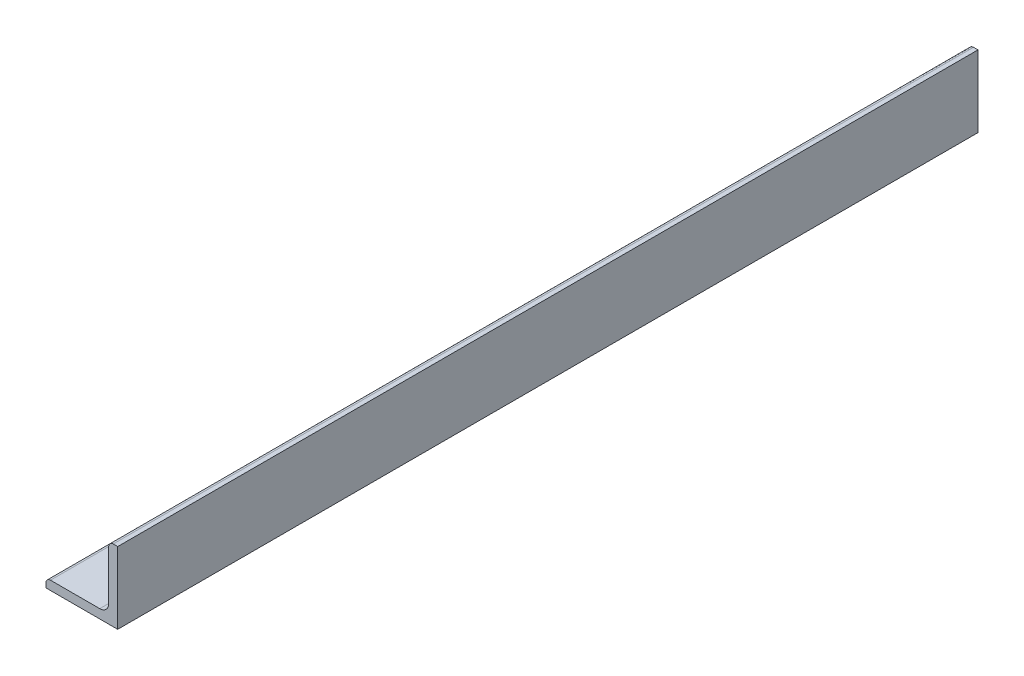
ISO-10303-21;
HEADER;
FILE_DESCRIPTION(('STEP AP214'),'2;1');
FILE_NAME('part.step','',(''),(''),'','','');
FILE_SCHEMA(('AUTOMOTIVE_DESIGN { 1 0 10303 214 1 1 1 1 }'));
ENDSEC;
DATA;
#1=APPLICATION_CONTEXT('core data for automotive mechanical design processes');
#2=APPLICATION_PROTOCOL_DEFINITION('international standard','automotive_design',2000,#1);
#3=PRODUCT_CONTEXT('',#1,'mechanical');
#4=PRODUCT('Part','Part','',(#3));
#5=PRODUCT_RELATED_PRODUCT_CATEGORY('part','',(#4));
#6=PRODUCT_DEFINITION_FORMATION('','',#4);
#7=PRODUCT_DEFINITION_CONTEXT('part definition',#1,'design');
#8=PRODUCT_DEFINITION('design','',#6,#7);
#9=PRODUCT_DEFINITION_SHAPE('','',#8);
#10=(LENGTH_UNIT() NAMED_UNIT(*) SI_UNIT(.MILLI.,.METRE.));
#11=(NAMED_UNIT(*) PLANE_ANGLE_UNIT() SI_UNIT($,.RADIAN.));
#12=(NAMED_UNIT(*) SI_UNIT($,.STERADIAN.) SOLID_ANGLE_UNIT());
#13=UNCERTAINTY_MEASURE_WITH_UNIT(LENGTH_MEASURE(1.E-05),#10,'distance_accuracy_value','');
#14=(GEOMETRIC_REPRESENTATION_CONTEXT(3) GLOBAL_UNCERTAINTY_ASSIGNED_CONTEXT((#13)) GLOBAL_UNIT_ASSIGNED_CONTEXT((#10,
#11,#12)) REPRESENTATION_CONTEXT('',''));
#15=CARTESIAN_POINT('',(0.,0.,0.));
#16=DIRECTION('',(0.,0.,1.));
#17=DIRECTION('',(1.,0.,0.));
#18=AXIS2_PLACEMENT_3D('',#15,#16,#17);
#19=CARTESIAN_POINT('',(-12.7,-11.1125,152.4));
#20=DIRECTION('',(1.,0.,0.));
#21=DIRECTION('',(0.,0.,-1.));
#22=AXIS2_PLACEMENT_3D('',#19,#20,#21);
#23=PLANE('',#22);
#24=DIRECTION('',(0.,-1.,0.));
#25=VECTOR('',#24,1.);
#26=CARTESIAN_POINT('',(-12.7,-11.1125,-152.4));
#27=LINE('',#26,#25);
#28=CARTESIAN_POINT('',(-12.7,-11.1125,-152.4));
#29=VERTEX_POINT('',#28);
#30=CARTESIAN_POINT('',(-12.7,-12.7,-152.4));
#31=VERTEX_POINT('',#30);
#32=EDGE_CURVE('E136',#29,#31,#27,.T.);
#33=ORIENTED_EDGE('',*,*,#32,.T.);
#34=DIRECTION('',(0.,0.,-1.));
#35=VECTOR('',#34,1.);
#36=CARTESIAN_POINT('',(-12.7,-12.7,152.4));
#37=LINE('',#36,#35);
#38=CARTESIAN_POINT('',(-12.7,-12.7,152.4));
#39=VERTEX_POINT('',#38);
#40=EDGE_CURVE('E11',#39,#31,#37,.T.);
#41=ORIENTED_EDGE('',*,*,#40,.F.);
#42=DIRECTION('',(0.,-1.,0.));
#43=VECTOR('',#42,1.);
#44=CARTESIAN_POINT('',(-12.7,-11.1125,152.4));
#45=LINE('',#44,#43);
#46=CARTESIAN_POINT('',(-12.7,-11.1125,152.4));
#47=VERTEX_POINT('',#46);
#48=EDGE_CURVE('E152',#47,#39,#45,.T.);
#49=ORIENTED_EDGE('',*,*,#48,.F.);
#50=DIRECTION('',(0.,0.,-1.));
#51=VECTOR('',#50,1.);
#52=CARTESIAN_POINT('',(-12.7,-11.1125,152.4));
#53=LINE('',#52,#51);
#54=EDGE_CURVE('E132',#47,#29,#53,.T.);
#55=ORIENTED_EDGE('',*,*,#54,.T.);
#56=EDGE_LOOP('',(#33,#41,#49,#55));
#57=FACE_BOUND('',#56,.T.);
#58=ADVANCED_FACE('F34',(#57),#23,.F.);
#59=CARTESIAN_POINT('',(-12.7,-12.7,152.4));
#60=DIRECTION('',(0.,1.,0.));
#61=DIRECTION('',(-1.,0.,0.));
#62=AXIS2_PLACEMENT_3D('',#59,#60,#61);
#63=PLANE('',#62);
#64=DIRECTION('',(1.,0.,0.));
#65=VECTOR('',#64,1.);
#66=CARTESIAN_POINT('',(-12.7,-12.7,-152.4));
#67=LINE('',#66,#65);
#68=CARTESIAN_POINT('',(12.7,-12.7,-152.4));
#69=VERTEX_POINT('',#68);
#70=EDGE_CURVE('E139',#31,#69,#67,.T.);
#71=ORIENTED_EDGE('',*,*,#70,.T.);
#72=DIRECTION('',(0.,0.,-1.));
#73=VECTOR('',#72,1.);
#74=CARTESIAN_POINT('',(12.7,-12.7,152.4));
#75=LINE('',#74,#73);
#76=CARTESIAN_POINT('',(12.7,-12.7,152.4));
#77=VERTEX_POINT('',#76);
#78=EDGE_CURVE('E42',#77,#69,#75,.T.);
#79=ORIENTED_EDGE('',*,*,#78,.F.);
#80=DIRECTION('',(1.,0.,0.));
#81=VECTOR('',#80,1.);
#82=CARTESIAN_POINT('',(-12.7,-12.7,152.4));
#83=LINE('',#82,#81);
#84=EDGE_CURVE('E96',#39,#77,#83,.T.);
#85=ORIENTED_EDGE('',*,*,#84,.F.);
#86=ORIENTED_EDGE('',*,*,#40,.T.);
#87=EDGE_LOOP('',(#71,#79,#85,#86));
#88=FACE_BOUND('',#87,.T.);
#89=ADVANCED_FACE('F195',(#88),#63,.F.);
#90=CARTESIAN_POINT('',(12.7,-12.7,152.4));
#91=DIRECTION('',(-1.,0.,0.));
#92=DIRECTION('',(0.,-1.,0.));
#93=AXIS2_PLACEMENT_3D('',#90,#91,#92);
#94=PLANE('',#93);
#95=DIRECTION('',(0.,1.,0.));
#96=VECTOR('',#95,1.);
#97=CARTESIAN_POINT('',(12.7,-12.7,-152.4));
#98=LINE('',#97,#96);
#99=CARTESIAN_POINT('',(12.7,12.7,-152.4));
#100=VERTEX_POINT('',#99);
#101=EDGE_CURVE('E141',#69,#100,#98,.T.);
#102=ORIENTED_EDGE('',*,*,#101,.T.);
#103=DIRECTION('',(0.,0.,-1.));
#104=VECTOR('',#103,1.);
#105=CARTESIAN_POINT('',(12.7,12.7,152.4));
#106=LINE('',#105,#104);
#107=CARTESIAN_POINT('',(12.7,12.7,152.4));
#108=VERTEX_POINT('',#107);
#109=EDGE_CURVE('E162',#108,#100,#106,.T.);
#110=ORIENTED_EDGE('',*,*,#109,.F.);
#111=DIRECTION('',(0.,1.,0.));
#112=VECTOR('',#111,1.);
#113=CARTESIAN_POINT('',(12.7,-12.7,152.4));
#114=LINE('',#113,#112);
#115=EDGE_CURVE('E170',#77,#108,#114,.T.);
#116=ORIENTED_EDGE('',*,*,#115,.F.);
#117=ORIENTED_EDGE('',*,*,#78,.T.);
#118=EDGE_LOOP('',(#102,#110,#116,#117));
#119=FACE_BOUND('',#118,.T.);
#120=ADVANCED_FACE('F168',(#119),#94,.F.);
#121=CARTESIAN_POINT('',(11.1125,12.7,152.4));
#122=DIRECTION('',(0.,-1.,0.));
#123=DIRECTION('',(0.,0.,-1.));
#124=AXIS2_PLACEMENT_3D('',#121,#122,#123);
#125=PLANE('',#124);
#126=DIRECTION('',(-1.,0.,0.));
#127=VECTOR('',#126,1.);
#128=CARTESIAN_POINT('',(11.1125,12.7,-152.4));
#129=LINE('',#128,#127);
#130=CARTESIAN_POINT('',(11.1125,12.7,-152.4));
#131=VERTEX_POINT('',#130);
#132=EDGE_CURVE('E143',#100,#131,#129,.T.);
#133=ORIENTED_EDGE('',*,*,#132,.T.);
#134=DIRECTION('',(0.,0.,-1.));
#135=VECTOR('',#134,1.);
#136=CARTESIAN_POINT('',(11.1125,12.7,152.4));
#137=LINE('',#136,#135);
#138=CARTESIAN_POINT('',(11.1125,12.7,152.4));
#139=VERTEX_POINT('',#138);
#140=EDGE_CURVE('E159',#139,#131,#137,.T.);
#141=ORIENTED_EDGE('',*,*,#140,.F.);
#142=DIRECTION('',(-1.,0.,0.));
#143=VECTOR('',#142,1.);
#144=CARTESIAN_POINT('',(11.1125,12.7,152.4));
#145=LINE('',#144,#143);
#146=EDGE_CURVE('E186',#108,#139,#145,.T.);
#147=ORIENTED_EDGE('',*,*,#146,.F.);
#148=ORIENTED_EDGE('',*,*,#109,.T.);
#149=EDGE_LOOP('',(#133,#141,#147,#148));
#150=FACE_BOUND('',#149,.T.);
#151=ADVANCED_FACE('F179',(#150),#125,.F.);
#152=CARTESIAN_POINT('',(11.1125,11.1125,152.4));
#153=DIRECTION('',(0.,0.,-1.));
#154=DIRECTION('',(-1.,0.,0.));
#155=AXIS2_PLACEMENT_3D('',#152,#153,#154);
#156=CYLINDRICAL_SURFACE('',#155,1.5875);
#157=CARTESIAN_POINT('',(11.1125,11.1125,-152.4));
#158=DIRECTION('',(0.,0.,1.));
#159=DIRECTION('',(-1.,0.,0.));
#160=AXIS2_PLACEMENT_3D('',#157,#158,#159);
#161=CIRCLE('',#160,1.5875);
#162=CARTESIAN_POINT('',(9.525,11.1125,-152.4));
#163=VERTEX_POINT('',#162);
#164=EDGE_CURVE('E145',#131,#163,#161,.T.);
#165=ORIENTED_EDGE('',*,*,#164,.T.);
#166=DIRECTION('',(0.,0.,-1.));
#167=VECTOR('',#166,1.);
#168=CARTESIAN_POINT('',(9.525,11.1125,152.4));
#169=LINE('',#168,#167);
#170=CARTESIAN_POINT('',(9.525,11.1125,152.4));
#171=VERTEX_POINT('',#170);
#172=EDGE_CURVE('E156',#171,#163,#169,.T.);
#173=ORIENTED_EDGE('',*,*,#172,.F.);
#174=CARTESIAN_POINT('',(11.1125,11.1125,152.4));
#175=DIRECTION('',(0.,0.,1.));
#176=DIRECTION('',(-1.,0.,0.));
#177=AXIS2_PLACEMENT_3D('',#174,#175,#176);
#178=CIRCLE('',#177,1.5875);
#179=EDGE_CURVE('E185',#139,#171,#178,.T.);
#180=ORIENTED_EDGE('',*,*,#179,.F.);
#181=ORIENTED_EDGE('',*,*,#140,.T.);
#182=EDGE_LOOP('',(#165,#173,#180,#181));
#183=FACE_BOUND('',#182,.T.);
#184=ADVANCED_FACE('F183',(#183),#156,.T.);
#185=CARTESIAN_POINT('',(9.525,11.1125,152.4));
#186=DIRECTION('',(1.,0.,0.));
#187=DIRECTION('',(0.,1.,0.));
#188=AXIS2_PLACEMENT_3D('',#185,#186,#187);
#189=PLANE('',#188);
#190=DIRECTION('',(0.,-1.,0.));
#191=VECTOR('',#190,1.);
#192=CARTESIAN_POINT('',(9.525,11.1125,-152.4));
#193=LINE('',#192,#191);
#194=CARTESIAN_POINT('',(9.525,-6.35,-152.4));
#195=VERTEX_POINT('',#194);
#196=EDGE_CURVE('E147',#163,#195,#193,.T.);
#197=ORIENTED_EDGE('',*,*,#196,.T.);
#198=DIRECTION('',(0.,0.,-1.));
#199=VECTOR('',#198,1.);
#200=CARTESIAN_POINT('',(9.525,-6.35,152.4));
#201=LINE('',#200,#199);
#202=CARTESIAN_POINT('',(9.525,-6.35,152.4));
#203=VERTEX_POINT('',#202);
#204=EDGE_CURVE('E127',#203,#195,#201,.T.);
#205=ORIENTED_EDGE('',*,*,#204,.F.);
#206=DIRECTION('',(0.,-1.,0.));
#207=VECTOR('',#206,1.);
#208=CARTESIAN_POINT('',(9.525,11.1125,152.4));
#209=LINE('',#208,#207);
#210=EDGE_CURVE('E118',#171,#203,#209,.T.);
#211=ORIENTED_EDGE('',*,*,#210,.F.);
#212=ORIENTED_EDGE('',*,*,#172,.T.);
#213=EDGE_LOOP('',(#197,#205,#211,#212));
#214=FACE_BOUND('',#213,.T.);
#215=ADVANCED_FACE('F207',(#214),#189,.F.);
#216=CARTESIAN_POINT('',(6.35,-6.35,152.4));
#217=DIRECTION('',(0.,0.,-1.));
#218=DIRECTION('',(-1.,0.,0.));
#219=AXIS2_PLACEMENT_3D('',#216,#217,#218);
#220=CYLINDRICAL_SURFACE('',#219,3.175);
#221=CARTESIAN_POINT('',(6.35,-6.35,-152.4));
#222=DIRECTION('',(0.,0.,-1.));
#223=DIRECTION('',(-1.,0.,0.));
#224=AXIS2_PLACEMENT_3D('',#221,#222,#223);
#225=CIRCLE('',#224,3.175);
#226=CARTESIAN_POINT('',(6.35,-9.525,-152.4));
#227=VERTEX_POINT('',#226);
#228=EDGE_CURVE('E126',#195,#227,#225,.T.);
#229=ORIENTED_EDGE('',*,*,#228,.T.);
#230=DIRECTION('',(0.,0.,-1.));
#231=VECTOR('',#230,1.);
#232=CARTESIAN_POINT('',(6.35,-9.525,152.4));
#233=LINE('',#232,#231);
#234=CARTESIAN_POINT('',(6.35,-9.525,152.4));
#235=VERTEX_POINT('',#234);
#236=EDGE_CURVE('E123',#235,#227,#233,.T.);
#237=ORIENTED_EDGE('',*,*,#236,.F.);
#238=CARTESIAN_POINT('',(6.35,-6.35,152.4));
#239=DIRECTION('',(0.,0.,-1.));
#240=DIRECTION('',(-1.,0.,0.));
#241=AXIS2_PLACEMENT_3D('',#238,#239,#240);
#242=CIRCLE('',#241,3.175);
#243=EDGE_CURVE('E112',#203,#235,#242,.T.);
#244=ORIENTED_EDGE('',*,*,#243,.F.);
#245=ORIENTED_EDGE('',*,*,#204,.T.);
#246=EDGE_LOOP('',(#229,#237,#244,#245));
#247=FACE_BOUND('',#246,.T.);
#248=ADVANCED_FACE('F124',(#247),#220,.F.);
#249=CARTESIAN_POINT('',(6.35,-9.525,152.4));
#250=DIRECTION('',(0.,-1.,0.));
#251=DIRECTION('',(1.,0.,0.));
#252=AXIS2_PLACEMENT_3D('',#249,#250,#251);
#253=PLANE('',#252);
#254=DIRECTION('',(-1.,0.,0.));
#255=VECTOR('',#254,1.);
#256=CARTESIAN_POINT('',(6.35,-9.525,-152.4));
#257=LINE('',#256,#255);
#258=CARTESIAN_POINT('',(-11.1125,-9.525,-152.4));
#259=VERTEX_POINT('',#258);
#260=EDGE_CURVE('E82',#227,#259,#257,.T.);
#261=ORIENTED_EDGE('',*,*,#260,.T.);
#262=DIRECTION('',(0.,0.,-1.));
#263=VECTOR('',#262,1.);
#264=CARTESIAN_POINT('',(-11.1125,-9.525,152.4));
#265=LINE('',#264,#263);
#266=CARTESIAN_POINT('',(-11.1125,-9.525,152.4));
#267=VERTEX_POINT('',#266);
#268=EDGE_CURVE('E128',#267,#259,#265,.T.);
#269=ORIENTED_EDGE('',*,*,#268,.F.);
#270=DIRECTION('',(-1.,0.,0.));
#271=VECTOR('',#270,1.);
#272=CARTESIAN_POINT('',(6.35,-9.525,152.4));
#273=LINE('',#272,#271);
#274=EDGE_CURVE('E116',#235,#267,#273,.T.);
#275=ORIENTED_EDGE('',*,*,#274,.F.);
#276=ORIENTED_EDGE('',*,*,#236,.T.);
#277=EDGE_LOOP('',(#261,#269,#275,#276));
#278=FACE_BOUND('',#277,.T.);
#279=ADVANCED_FACE('F130',(#278),#253,.F.);
#280=CARTESIAN_POINT('',(-11.1125,-11.1125,152.4));
#281=DIRECTION('',(0.,0.,-1.));
#282=DIRECTION('',(-1.,0.,0.));
#283=AXIS2_PLACEMENT_3D('',#280,#281,#282);
#284=CYLINDRICAL_SURFACE('',#283,1.5875);
#285=CARTESIAN_POINT('',(-11.1125,-11.1125,-152.4));
#286=DIRECTION('',(0.,0.,1.));
#287=DIRECTION('',(-1.,0.,0.));
#288=AXIS2_PLACEMENT_3D('',#285,#286,#287);
#289=CIRCLE('',#288,1.5875);
#290=EDGE_CURVE('E88',#259,#29,#289,.T.);
#291=ORIENTED_EDGE('',*,*,#290,.T.);
#292=ORIENTED_EDGE('',*,*,#54,.F.);
#293=CARTESIAN_POINT('',(-11.1125,-11.1125,152.4));
#294=DIRECTION('',(0.,0.,1.));
#295=DIRECTION('',(-1.,0.,0.));
#296=AXIS2_PLACEMENT_3D('',#293,#294,#295);
#297=CIRCLE('',#296,1.5875);
#298=EDGE_CURVE('E50',#267,#47,#297,.T.);
#299=ORIENTED_EDGE('',*,*,#298,.F.);
#300=ORIENTED_EDGE('',*,*,#268,.T.);
#301=EDGE_LOOP('',(#291,#292,#299,#300));
#302=FACE_BOUND('',#301,.T.);
#303=ADVANCED_FACE('F215',(#302),#284,.T.);
#304=CARTESIAN_POINT('',(11.1125,11.1125,152.4));
#305=DIRECTION('',(0.,0.,-1.));
#306=DIRECTION('',(-1.,0.,0.));
#307=AXIS2_PLACEMENT_3D('',#304,#305,#306);
#308=PLANE('',#307);
#309=ORIENTED_EDGE('',*,*,#48,.T.);
#310=ORIENTED_EDGE('',*,*,#84,.T.);
#311=ORIENTED_EDGE('',*,*,#115,.T.);
#312=ORIENTED_EDGE('',*,*,#146,.T.);
#313=ORIENTED_EDGE('',*,*,#179,.T.);
#314=ORIENTED_EDGE('',*,*,#210,.T.);
#315=ORIENTED_EDGE('',*,*,#243,.T.);
#316=ORIENTED_EDGE('',*,*,#274,.T.);
#317=ORIENTED_EDGE('',*,*,#298,.T.);
#318=EDGE_LOOP('',(#309,#310,#311,#312,#313,#314,#315,#316,#317));
#319=FACE_BOUND('',#318,.T.);
#320=ADVANCED_FACE('F114',(#319),#308,.F.);
#321=CARTESIAN_POINT('',(11.1125,11.1125,-152.4));
#322=DIRECTION('',(0.,0.,-1.));
#323=DIRECTION('',(-1.,0.,0.));
#324=AXIS2_PLACEMENT_3D('',#321,#322,#323);
#325=PLANE('',#324);
#326=ORIENTED_EDGE('',*,*,#32,.F.);
#327=ORIENTED_EDGE('',*,*,#290,.F.);
#328=ORIENTED_EDGE('',*,*,#260,.F.);
#329=ORIENTED_EDGE('',*,*,#228,.F.);
#330=ORIENTED_EDGE('',*,*,#196,.F.);
#331=ORIENTED_EDGE('',*,*,#164,.F.);
#332=ORIENTED_EDGE('',*,*,#132,.F.);
#333=ORIENTED_EDGE('',*,*,#101,.F.);
#334=ORIENTED_EDGE('',*,*,#70,.F.);
#335=EDGE_LOOP('',(#326,#327,#328,#329,#330,#331,#332,#333,#334));
#336=FACE_BOUND('',#335,.T.);
#337=ADVANCED_FACE('F174',(#336),#325,.T.);
#338=CLOSED_SHELL('',(#58,#89,#120,#151,#184,#215,#248,#279,#303,#320,#337));
#339=MANIFOLD_SOLID_BREP('B2',#338);
#340=ADVANCED_BREP_SHAPE_REPRESENTATION('',(#18,#339),#14);
#341=SHAPE_DEFINITION_REPRESENTATION(#9,#340);
ENDSEC;
END-ISO-10303-21;
